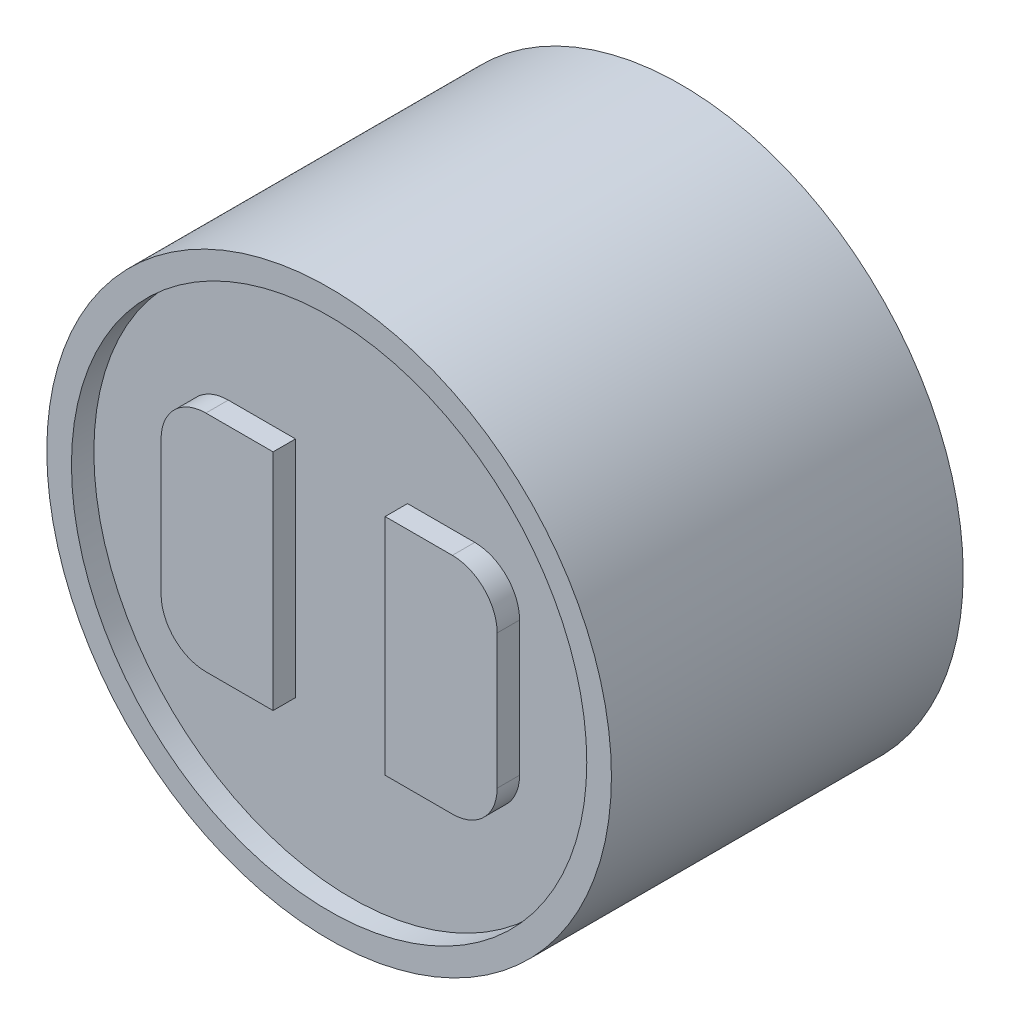
ISO-10303-21;
HEADER;
FILE_DESCRIPTION(('STEP AP214'),'2;1');
FILE_NAME('part.step','',(''),(''),'','','');
FILE_SCHEMA(('AUTOMOTIVE_DESIGN { 1 0 10303 214 1 1 1 1 }'));
ENDSEC;
DATA;
#1=APPLICATION_CONTEXT('core data for automotive mechanical design processes');
#2=APPLICATION_PROTOCOL_DEFINITION('international standard','automotive_design',2000,#1);
#3=PRODUCT_CONTEXT('',#1,'mechanical');
#4=PRODUCT('Part','Part','',(#3));
#5=PRODUCT_RELATED_PRODUCT_CATEGORY('part','',(#4));
#6=PRODUCT_DEFINITION_FORMATION('','',#4);
#7=PRODUCT_DEFINITION_CONTEXT('part definition',#1,'design');
#8=PRODUCT_DEFINITION('design','',#6,#7);
#9=PRODUCT_DEFINITION_SHAPE('','',#8);
#10=(LENGTH_UNIT() NAMED_UNIT(*) SI_UNIT(.MILLI.,.METRE.));
#11=(NAMED_UNIT(*) PLANE_ANGLE_UNIT() SI_UNIT($,.RADIAN.));
#12=(NAMED_UNIT(*) SI_UNIT($,.STERADIAN.) SOLID_ANGLE_UNIT());
#13=UNCERTAINTY_MEASURE_WITH_UNIT(LENGTH_MEASURE(1.E-05),#10,'distance_accuracy_value','');
#14=(GEOMETRIC_REPRESENTATION_CONTEXT(3) GLOBAL_UNCERTAINTY_ASSIGNED_CONTEXT((#13)) GLOBAL_UNIT_ASSIGNED_CONTEXT((#10,
#11,#12)) REPRESENTATION_CONTEXT('',''));
#15=CARTESIAN_POINT('',(0.,0.,0.));
#16=DIRECTION('',(0.,0.,1.));
#17=DIRECTION('',(1.,0.,0.));
#18=AXIS2_PLACEMENT_3D('',#15,#16,#17);
#19=CARTESIAN_POINT('',(-3.2333237010954,-8.71020362159421,28.1888965279297));
#20=DIRECTION('',(0.,0.,-1.));
#21=DIRECTION('',(-1.,0.,0.));
#22=AXIS2_PLACEMENT_3D('',#19,#20,#21);
#23=PLANE('',#22);
#24=CARTESIAN_POINT('',(-3.23332370109542,-7.18620362159421,28.1888965279297));
#25=DIRECTION('',(0.,0.,-1.));
#26=DIRECTION('',(-1.,0.,0.));
#27=AXIS2_PLACEMENT_3D('',#24,#25,#26);
#28=CIRCLE('',#27,0.508);
#29=CARTESIAN_POINT('',(-3.74132370109542,-7.18620362159421,28.1888965279297));
#30=VERTEX_POINT('',#29);
#31=CARTESIAN_POINT('',(-3.23332370109542,-6.67820362159421,28.1888965279297));
#32=VERTEX_POINT('',#31);
#33=EDGE_CURVE('E128',#30,#32,#28,.T.);
#34=ORIENTED_EDGE('',*,*,#33,.F.);
#35=DIRECTION('',(0.,1.,0.));
#36=VECTOR('',#35,1.);
#37=CARTESIAN_POINT('',(-3.74132370109541,-8.71020362159421,28.1888965279297));
#38=LINE('',#37,#36);
#39=CARTESIAN_POINT('',(-3.74132370109541,-8.71020362159421,28.1888965279297));
#40=VERTEX_POINT('',#39);
#41=EDGE_CURVE('E116',#40,#30,#38,.T.);
#42=ORIENTED_EDGE('',*,*,#41,.F.);
#43=CARTESIAN_POINT('',(-3.2333237010954,-8.71020362159421,28.1888965279297));
#44=DIRECTION('',(0.,0.,-1.));
#45=DIRECTION('',(-1.,0.,0.));
#46=AXIS2_PLACEMENT_3D('',#43,#44,#45);
#47=CIRCLE('',#46,0.508);
#48=CARTESIAN_POINT('',(-3.2333237010954,-9.21820362159421,28.1888965279297));
#49=VERTEX_POINT('',#48);
#50=EDGE_CURVE('E35',#49,#40,#47,.T.);
#51=ORIENTED_EDGE('',*,*,#50,.F.);
#52=DIRECTION('',(-1.,0.,0.));
#53=VECTOR('',#52,1.);
#54=CARTESIAN_POINT('',(-3.2333237010954,-9.21820362159421,28.1888965279297));
#55=LINE('',#54,#53);
#56=CARTESIAN_POINT('',(-2.4713237010954,-9.2182036215942,28.1888965279297));
#57=VERTEX_POINT('',#56);
#58=EDGE_CURVE('E103',#57,#49,#55,.T.);
#59=ORIENTED_EDGE('',*,*,#58,.F.);
#60=DIRECTION('',(0.,1.,0.));
#61=VECTOR('',#60,1.);
#62=CARTESIAN_POINT('',(-2.4713237010954,-9.2182036215942,28.1888965279297));
#63=LINE('',#62,#61);
#64=CARTESIAN_POINT('',(-2.47132370109542,-6.6782036215942,28.1888965279297));
#65=VERTEX_POINT('',#64);
#66=EDGE_CURVE('E189',#57,#65,#63,.T.);
#67=ORIENTED_EDGE('',*,*,#66,.T.);
#68=DIRECTION('',(-1.,0.,0.));
#69=VECTOR('',#68,1.);
#70=CARTESIAN_POINT('',(-3.23332370109542,-6.67820362159421,28.1888965279297));
#71=LINE('',#70,#69);
#72=EDGE_CURVE('E174',#65,#32,#71,.T.);
#73=ORIENTED_EDGE('',*,*,#72,.T.);
#74=EDGE_LOOP('',(#34,#42,#51,#59,#67,#73));
#75=FACE_BOUND('',#74,.T.);
#76=ADVANCED_FACE('F32',(#75),#23,.F.);
#77=CARTESIAN_POINT('',(-0.439323701095408,-8.71020362159419,28.1888965279297));
#78=DIRECTION('',(0.,0.,-1.));
#79=DIRECTION('',(-1.,0.,0.));
#80=AXIS2_PLACEMENT_3D('',#77,#78,#79);
#81=PLANE('',#80);
#82=CARTESIAN_POINT('',(-0.439323701095408,-8.71020362159419,28.1888965279297));
#83=DIRECTION('',(0.,0.,-1.));
#84=DIRECTION('',(-1.,0.,0.));
#85=AXIS2_PLACEMENT_3D('',#82,#83,#84);
#86=CIRCLE('',#85,0.508);
#87=CARTESIAN_POINT('',(0.0686762989045922,-8.71020362159418,28.1888965279297));
#88=VERTEX_POINT('',#87);
#89=CARTESIAN_POINT('',(-0.439323701095406,-9.21820362159419,28.1888965279297));
#90=VERTEX_POINT('',#89);
#91=EDGE_CURVE('E124',#88,#90,#86,.T.);
#92=ORIENTED_EDGE('',*,*,#91,.F.);
#93=DIRECTION('',(0.,1.,0.));
#94=VECTOR('',#93,1.);
#95=CARTESIAN_POINT('',(0.0686762989045922,-8.71020362159418,28.1888965279297));
#96=LINE('',#95,#94);
#97=CARTESIAN_POINT('',(0.0686762989045801,-7.18620362159418,28.1888965279297));
#98=VERTEX_POINT('',#97);
#99=EDGE_CURVE('E175',#98,#88,#96,.F.);
#100=ORIENTED_EDGE('',*,*,#99,.F.);
#101=CARTESIAN_POINT('',(-0.439323701095418,-7.18620362159419,28.1888965279297));
#102=DIRECTION('',(0.,0.,-1.));
#103=DIRECTION('',(-1.,0.,0.));
#104=AXIS2_PLACEMENT_3D('',#101,#102,#103);
#105=CIRCLE('',#104,0.508);
#106=CARTESIAN_POINT('',(-0.439323701095425,-6.67820362159419,28.1888965279297));
#107=VERTEX_POINT('',#106);
#108=EDGE_CURVE('E132',#107,#98,#105,.T.);
#109=ORIENTED_EDGE('',*,*,#108,.F.);
#110=DIRECTION('',(-1.,0.,0.));
#111=VECTOR('',#110,1.);
#112=CARTESIAN_POINT('',(-0.439323701095422,-6.67820362159419,28.1888965279297));
#113=LINE('',#112,#111);
#114=CARTESIAN_POINT('',(-1.20132370109542,-6.67820362159419,28.1888965279297));
#115=VERTEX_POINT('',#114);
#116=EDGE_CURVE('E130',#115,#107,#113,.F.);
#117=ORIENTED_EDGE('',*,*,#116,.F.);
#118=DIRECTION('',(0.,-1.,0.));
#119=VECTOR('',#118,1.);
#120=CARTESIAN_POINT('',(-1.2013237010954,-9.21820362159419,28.1888965279297));
#121=LINE('',#120,#119);
#122=CARTESIAN_POINT('',(-1.2013237010954,-9.21820362159419,28.1888965279297));
#123=VERTEX_POINT('',#122);
#124=EDGE_CURVE('E204',#115,#123,#121,.T.);
#125=ORIENTED_EDGE('',*,*,#124,.T.);
#126=DIRECTION('',(1.,0.,0.));
#127=VECTOR('',#126,1.);
#128=CARTESIAN_POINT('',(-1.2013237010954,-9.21820362159419,28.1888965279297));
#129=LINE('',#128,#127);
#130=EDGE_CURVE('E173',#123,#90,#129,.T.);
#131=ORIENTED_EDGE('',*,*,#130,.T.);
#132=EDGE_LOOP('',(#92,#100,#109,#117,#125,#131));
#133=FACE_BOUND('',#132,.T.);
#134=ADVANCED_FACE('F296',(#133),#81,.F.);
#135=CARTESIAN_POINT('',(-3.23332370109542,-7.18620362159421,28.1888965279297));
#136=DIRECTION('',(0.,0.,-1.));
#137=DIRECTION('',(-1.,0.,0.));
#138=AXIS2_PLACEMENT_3D('',#135,#136,#137);
#139=CYLINDRICAL_SURFACE('',#138,0.508);
#140=ORIENTED_EDGE('',*,*,#33,.T.);
#141=DIRECTION('',(0.,0.,-1.));
#142=VECTOR('',#141,1.);
#143=CARTESIAN_POINT('',(-3.23332370109542,-6.67820362159421,28.1888965279297));
#144=LINE('',#143,#142);
#145=CARTESIAN_POINT('',(-3.23332370109542,-6.67820362159421,27.9348965279297));
#146=VERTEX_POINT('',#145);
#147=EDGE_CURVE('E193',#32,#146,#144,.T.);
#148=ORIENTED_EDGE('',*,*,#147,.T.);
#149=CARTESIAN_POINT('',(-3.23332370109542,-7.18620362159421,27.9348965279297));
#150=DIRECTION('',(0.,0.,-1.));
#151=DIRECTION('',(-1.,0.,0.));
#152=AXIS2_PLACEMENT_3D('',#149,#150,#151);
#153=CIRCLE('',#152,0.508);
#154=CARTESIAN_POINT('',(-3.74132370109542,-7.18620362159421,27.9348965279297));
#155=VERTEX_POINT('',#154);
#156=EDGE_CURVE('E167',#155,#146,#153,.T.);
#157=ORIENTED_EDGE('',*,*,#156,.F.);
#158=DIRECTION('',(0.,0.,-1.));
#159=VECTOR('',#158,1.);
#160=CARTESIAN_POINT('',(-3.74132370109542,-7.18620362159421,28.1888965279297));
#161=LINE('',#160,#159);
#162=EDGE_CURVE('E125',#155,#30,#161,.F.);
#163=ORIENTED_EDGE('',*,*,#162,.T.);
#164=EDGE_LOOP('',(#140,#148,#157,#163));
#165=FACE_BOUND('',#164,.T.);
#166=ADVANCED_FACE('F450',(#165),#139,.T.);
#167=CARTESIAN_POINT('',(-3.23332370109542,-6.67820362159421,28.1888965279297));
#168=DIRECTION('',(0.,-1.,0.));
#169=DIRECTION('',(-1.,0.,0.));
#170=AXIS2_PLACEMENT_3D('',#167,#168,#169);
#171=PLANE('',#170);
#172=ORIENTED_EDGE('',*,*,#147,.F.);
#173=ORIENTED_EDGE('',*,*,#72,.F.);
#174=DIRECTION('',(0.,0.,-1.));
#175=VECTOR('',#174,1.);
#176=CARTESIAN_POINT('',(-2.47132370109542,-6.6782036215942,28.1888965279297));
#177=LINE('',#176,#175);
#178=CARTESIAN_POINT('',(-2.47132370109542,-6.6782036215942,27.9348965279297));
#179=VERTEX_POINT('',#178);
#180=EDGE_CURVE('E192',#65,#179,#177,.T.);
#181=ORIENTED_EDGE('',*,*,#180,.T.);
#182=DIRECTION('',(1.,0.,0.));
#183=VECTOR('',#182,1.);
#184=CARTESIAN_POINT('',(-1.83632370109542,-6.6782036215942,27.9348965279297));
#185=LINE('',#184,#183);
#186=EDGE_CURVE('E170',#146,#179,#185,.T.);
#187=ORIENTED_EDGE('',*,*,#186,.F.);
#188=EDGE_LOOP('',(#172,#173,#181,#187));
#189=FACE_BOUND('',#188,.T.);
#190=ADVANCED_FACE('F235',(#189),#171,.F.);
#191=CARTESIAN_POINT('',(-2.4713237010954,-9.2182036215942,28.1888965279297));
#192=DIRECTION('',(-1.,0.,0.));
#193=DIRECTION('',(0.,1.,0.));
#194=AXIS2_PLACEMENT_3D('',#191,#192,#193);
#195=PLANE('',#194);
#196=ORIENTED_EDGE('',*,*,#180,.F.);
#197=ORIENTED_EDGE('',*,*,#66,.F.);
#198=DIRECTION('',(0.,0.,-1.));
#199=VECTOR('',#198,1.);
#200=CARTESIAN_POINT('',(-2.4713237010954,-9.2182036215942,28.1888965279297));
#201=LINE('',#200,#199);
#202=CARTESIAN_POINT('',(-2.4713237010954,-9.2182036215942,27.9348965279297));
#203=VERTEX_POINT('',#202);
#204=EDGE_CURVE('E222',#57,#203,#201,.T.);
#205=ORIENTED_EDGE('',*,*,#204,.T.);
#206=DIRECTION('',(0.,1.,0.));
#207=VECTOR('',#206,1.);
#208=CARTESIAN_POINT('',(-2.47132370109541,-7.9482036215942,27.9348965279297));
#209=LINE('',#208,#207);
#210=EDGE_CURVE('E227',#179,#203,#209,.F.);
#211=ORIENTED_EDGE('',*,*,#210,.F.);
#212=EDGE_LOOP('',(#196,#197,#205,#211));
#213=FACE_BOUND('',#212,.T.);
#214=ADVANCED_FACE('F240',(#213),#195,.F.);
#215=CARTESIAN_POINT('',(-3.2333237010954,-9.21820362159421,28.1888965279297));
#216=DIRECTION('',(0.,1.,0.));
#217=DIRECTION('',(1.,0.,0.));
#218=AXIS2_PLACEMENT_3D('',#215,#216,#217);
#219=PLANE('',#218);
#220=ORIENTED_EDGE('',*,*,#204,.F.);
#221=ORIENTED_EDGE('',*,*,#58,.T.);
#222=DIRECTION('',(0.,0.,-1.));
#223=VECTOR('',#222,1.);
#224=CARTESIAN_POINT('',(-3.2333237010954,-9.21820362159421,28.1888965279297));
#225=LINE('',#224,#223);
#226=CARTESIAN_POINT('',(-3.2333237010954,-9.21820362159421,27.9348965279297));
#227=VERTEX_POINT('',#226);
#228=EDGE_CURVE('E113',#227,#49,#225,.F.);
#229=ORIENTED_EDGE('',*,*,#228,.F.);
#230=DIRECTION('',(1.,0.,0.));
#231=VECTOR('',#230,1.);
#232=CARTESIAN_POINT('',(-1.8363237010954,-9.2182036215942,27.9348965279297));
#233=LINE('',#232,#231);
#234=EDGE_CURVE('E166',#203,#227,#233,.F.);
#235=ORIENTED_EDGE('',*,*,#234,.F.);
#236=EDGE_LOOP('',(#220,#221,#229,#235));
#237=FACE_BOUND('',#236,.T.);
#238=ADVANCED_FACE('F290',(#237),#219,.F.);
#239=CARTESIAN_POINT('',(-3.2333237010954,-8.71020362159421,28.1888965279297));
#240=DIRECTION('',(0.,0.,-1.));
#241=DIRECTION('',(-1.,0.,0.));
#242=AXIS2_PLACEMENT_3D('',#239,#240,#241);
#243=CYLINDRICAL_SURFACE('',#242,0.508);
#244=ORIENTED_EDGE('',*,*,#50,.T.);
#245=DIRECTION('',(0.,0.,-1.));
#246=VECTOR('',#245,1.);
#247=CARTESIAN_POINT('',(-3.74132370109541,-8.71020362159421,28.1888965279297));
#248=LINE('',#247,#246);
#249=CARTESIAN_POINT('',(-3.74132370109541,-8.71020362159421,27.9348965279297));
#250=VERTEX_POINT('',#249);
#251=EDGE_CURVE('E111',#40,#250,#248,.T.);
#252=ORIENTED_EDGE('',*,*,#251,.T.);
#253=CARTESIAN_POINT('',(-3.2333237010954,-8.71020362159421,27.9348965279297));
#254=DIRECTION('',(0.,0.,-1.));
#255=DIRECTION('',(-1.,0.,0.));
#256=AXIS2_PLACEMENT_3D('',#253,#254,#255);
#257=CIRCLE('',#256,0.508);
#258=EDGE_CURVE('E164',#227,#250,#257,.T.);
#259=ORIENTED_EDGE('',*,*,#258,.F.);
#260=ORIENTED_EDGE('',*,*,#228,.T.);
#261=EDGE_LOOP('',(#244,#252,#259,#260));
#262=FACE_BOUND('',#261,.T.);
#263=ADVANCED_FACE('F109',(#262),#243,.T.);
#264=CARTESIAN_POINT('',(-3.74132370109541,-8.71020362159421,28.1888965279297));
#265=DIRECTION('',(1.,0.,0.));
#266=DIRECTION('',(0.,-1.,0.));
#267=AXIS2_PLACEMENT_3D('',#264,#265,#266);
#268=PLANE('',#267);
#269=ORIENTED_EDGE('',*,*,#251,.F.);
#270=ORIENTED_EDGE('',*,*,#41,.T.);
#271=ORIENTED_EDGE('',*,*,#162,.F.);
#272=DIRECTION('',(0.,1.,0.));
#273=VECTOR('',#272,1.);
#274=CARTESIAN_POINT('',(-3.74132370109542,-7.94820362159421,27.9348965279297));
#275=LINE('',#274,#273);
#276=EDGE_CURVE('E122',#250,#155,#275,.T.);
#277=ORIENTED_EDGE('',*,*,#276,.F.);
#278=EDGE_LOOP('',(#269,#270,#271,#277));
#279=FACE_BOUND('',#278,.T.);
#280=ADVANCED_FACE('F118',(#279),#268,.F.);
#281=CARTESIAN_POINT('',(-0.439323701095408,-8.71020362159419,28.1888965279297));
#282=DIRECTION('',(0.,0.,-1.));
#283=DIRECTION('',(-1.,0.,0.));
#284=AXIS2_PLACEMENT_3D('',#281,#282,#283);
#285=CYLINDRICAL_SURFACE('',#284,0.508);
#286=ORIENTED_EDGE('',*,*,#91,.T.);
#287=DIRECTION('',(0.,0.,-1.));
#288=VECTOR('',#287,1.);
#289=CARTESIAN_POINT('',(-0.439323701095408,-9.21820362159419,28.1888965279297));
#290=LINE('',#289,#288);
#291=CARTESIAN_POINT('',(-0.439323701095406,-9.21820362159419,27.9348965279297));
#292=VERTEX_POINT('',#291);
#293=EDGE_CURVE('E208',#90,#292,#290,.T.);
#294=ORIENTED_EDGE('',*,*,#293,.T.);
#295=CARTESIAN_POINT('',(-0.439323701095408,-8.71020362159419,27.9348965279297));
#296=DIRECTION('',(0.,0.,-1.));
#297=DIRECTION('',(-1.,0.,0.));
#298=AXIS2_PLACEMENT_3D('',#295,#296,#297);
#299=CIRCLE('',#298,0.508);
#300=CARTESIAN_POINT('',(0.0686762989045922,-8.71020362159418,27.9348965279297));
#301=VERTEX_POINT('',#300);
#302=EDGE_CURVE('E160',#301,#292,#299,.T.);
#303=ORIENTED_EDGE('',*,*,#302,.F.);
#304=DIRECTION('',(0.,0.,-1.));
#305=VECTOR('',#304,1.);
#306=CARTESIAN_POINT('',(0.0686762989045922,-8.71020362159418,28.1888965279297));
#307=LINE('',#306,#305);
#308=EDGE_CURVE('E253',#301,#88,#307,.F.);
#309=ORIENTED_EDGE('',*,*,#308,.T.);
#310=EDGE_LOOP('',(#286,#294,#303,#309));
#311=FACE_BOUND('',#310,.T.);
#312=ADVANCED_FACE('F302',(#311),#285,.T.);
#313=CARTESIAN_POINT('',(-1.2013237010954,-9.21820362159419,28.1888965279297));
#314=DIRECTION('',(0.,1.,0.));
#315=DIRECTION('',(1.,0.,0.));
#316=AXIS2_PLACEMENT_3D('',#313,#314,#315);
#317=PLANE('',#316);
#318=ORIENTED_EDGE('',*,*,#293,.F.);
#319=ORIENTED_EDGE('',*,*,#130,.F.);
#320=DIRECTION('',(0.,0.,-1.));
#321=VECTOR('',#320,1.);
#322=CARTESIAN_POINT('',(-1.2013237010954,-9.21820362159419,28.1888965279297));
#323=LINE('',#322,#321);
#324=CARTESIAN_POINT('',(-1.2013237010954,-9.21820362159419,27.9348965279297));
#325=VERTEX_POINT('',#324);
#326=EDGE_CURVE('E207',#123,#325,#323,.T.);
#327=ORIENTED_EDGE('',*,*,#326,.T.);
#328=DIRECTION('',(1.,0.,0.));
#329=VECTOR('',#328,1.);
#330=CARTESIAN_POINT('',(-1.8363237010954,-9.2182036215942,27.9348965279297));
#331=LINE('',#330,#329);
#332=EDGE_CURVE('E163',#292,#325,#331,.F.);
#333=ORIENTED_EDGE('',*,*,#332,.F.);
#334=EDGE_LOOP('',(#318,#319,#327,#333));
#335=FACE_BOUND('',#334,.T.);
#336=ADVANCED_FACE('F271',(#335),#317,.F.);
#337=CARTESIAN_POINT('',(-1.2013237010954,-9.21820362159419,28.1888965279297));
#338=DIRECTION('',(1.,0.,0.));
#339=DIRECTION('',(0.,-1.,0.));
#340=AXIS2_PLACEMENT_3D('',#337,#338,#339);
#341=PLANE('',#340);
#342=ORIENTED_EDGE('',*,*,#326,.F.);
#343=ORIENTED_EDGE('',*,*,#124,.F.);
#344=DIRECTION('',(0.,0.,-1.));
#345=VECTOR('',#344,1.);
#346=CARTESIAN_POINT('',(-1.20132370109542,-6.67820362159419,28.1888965279297));
#347=LINE('',#346,#345);
#348=CARTESIAN_POINT('',(-1.20132370109542,-6.67820362159419,27.9348965279297));
#349=VERTEX_POINT('',#348);
#350=EDGE_CURVE('E258',#115,#349,#347,.T.);
#351=ORIENTED_EDGE('',*,*,#350,.T.);
#352=DIRECTION('',(0.,1.,0.));
#353=VECTOR('',#352,1.);
#354=CARTESIAN_POINT('',(-1.20132370109541,-7.94820362159419,27.9348965279297));
#355=LINE('',#354,#353);
#356=EDGE_CURVE('E263',#325,#349,#355,.T.);
#357=ORIENTED_EDGE('',*,*,#356,.F.);
#358=EDGE_LOOP('',(#342,#343,#351,#357));
#359=FACE_BOUND('',#358,.T.);
#360=ADVANCED_FACE('F276',(#359),#341,.F.);
#361=CARTESIAN_POINT('',(-1.20132370109542,-6.67820362159419,28.1888965279297));
#362=DIRECTION('',(0.,-1.,0.));
#363=DIRECTION('',(-1.,0.,0.));
#364=AXIS2_PLACEMENT_3D('',#361,#362,#363);
#365=PLANE('',#364);
#366=ORIENTED_EDGE('',*,*,#350,.F.);
#367=ORIENTED_EDGE('',*,*,#116,.T.);
#368=DIRECTION('',(0.,0.,-1.));
#369=VECTOR('',#368,1.);
#370=CARTESIAN_POINT('',(-0.439323701095427,-6.67820362159419,28.1888965279297));
#371=LINE('',#370,#369);
#372=CARTESIAN_POINT('',(-0.439323701095425,-6.67820362159419,27.9348965279297));
#373=VERTEX_POINT('',#372);
#374=EDGE_CURVE('E256',#373,#107,#371,.F.);
#375=ORIENTED_EDGE('',*,*,#374,.F.);
#376=DIRECTION('',(1.,0.,0.));
#377=VECTOR('',#376,1.);
#378=CARTESIAN_POINT('',(-1.83632370109542,-6.6782036215942,27.9348965279297));
#379=LINE('',#378,#377);
#380=EDGE_CURVE('E159',#349,#373,#379,.T.);
#381=ORIENTED_EDGE('',*,*,#380,.F.);
#382=EDGE_LOOP('',(#366,#367,#375,#381));
#383=FACE_BOUND('',#382,.T.);
#384=ADVANCED_FACE('F298',(#383),#365,.F.);
#385=CARTESIAN_POINT('',(-0.439323701095418,-7.18620362159419,28.1888965279297));
#386=DIRECTION('',(0.,0.,-1.));
#387=DIRECTION('',(-1.,0.,0.));
#388=AXIS2_PLACEMENT_3D('',#385,#386,#387);
#389=CYLINDRICAL_SURFACE('',#388,0.508);
#390=ORIENTED_EDGE('',*,*,#108,.T.);
#391=DIRECTION('',(0.,0.,-1.));
#392=VECTOR('',#391,1.);
#393=CARTESIAN_POINT('',(0.0686762989045801,-7.18620362159418,28.1888965279297));
#394=LINE('',#393,#392);
#395=CARTESIAN_POINT('',(0.0686762989045801,-7.18620362159418,27.9348965279297));
#396=VERTEX_POINT('',#395);
#397=EDGE_CURVE('E50',#98,#396,#394,.T.);
#398=ORIENTED_EDGE('',*,*,#397,.T.);
#399=CARTESIAN_POINT('',(-0.439323701095418,-7.18620362159419,27.9348965279297));
#400=DIRECTION('',(0.,0.,-1.));
#401=DIRECTION('',(-1.,0.,0.));
#402=AXIS2_PLACEMENT_3D('',#399,#400,#401);
#403=CIRCLE('',#402,0.508);
#404=EDGE_CURVE('E156',#373,#396,#403,.T.);
#405=ORIENTED_EDGE('',*,*,#404,.F.);
#406=ORIENTED_EDGE('',*,*,#374,.T.);
#407=EDGE_LOOP('',(#390,#398,#405,#406));
#408=FACE_BOUND('',#407,.T.);
#409=ADVANCED_FACE('F343',(#408),#389,.T.);
#410=CARTESIAN_POINT('',(0.0686762989045922,-8.71020362159418,28.1888965279297));
#411=DIRECTION('',(-1.,0.,0.));
#412=DIRECTION('',(0.,1.,0.));
#413=AXIS2_PLACEMENT_3D('',#410,#411,#412);
#414=PLANE('',#413);
#415=ORIENTED_EDGE('',*,*,#397,.F.);
#416=ORIENTED_EDGE('',*,*,#99,.T.);
#417=ORIENTED_EDGE('',*,*,#308,.F.);
#418=DIRECTION('',(0.,1.,0.));
#419=VECTOR('',#418,1.);
#420=CARTESIAN_POINT('',(0.068676298904587,-7.94820362159418,27.9348965279297));
#421=LINE('',#420,#419);
#422=EDGE_CURVE('E155',#396,#301,#421,.F.);
#423=ORIENTED_EDGE('',*,*,#422,.F.);
#424=EDGE_LOOP('',(#415,#416,#417,#423));
#425=FACE_BOUND('',#424,.T.);
#426=ADVANCED_FACE('F301',(#425),#414,.F.);
#427=CARTESIAN_POINT('',(-1.83632370109541,-7.9482036215942,24.8360965279297));
#428=DIRECTION('',(0.,0.,-1.));
#429=DIRECTION('',(-1.,0.,0.));
#430=AXIS2_PLACEMENT_3D('',#427,#428,#429);
#431=PLANE('',#430);
#432=CARTESIAN_POINT('',(-1.83632370109541,-7.9482036215942,24.8360965279297));
#433=DIRECTION('',(0.,0.,-1.));
#434=DIRECTION('',(-1.,0.,0.));
#435=AXIS2_PLACEMENT_3D('',#432,#433,#434);
#436=CIRCLE('',#435,0.635);
#437=CARTESIAN_POINT('',(-2.47132370109541,-7.94820362159421,24.8360965279297));
#438=VERTEX_POINT('',#437);
#439=EDGE_CURVE('E152',#438,#438,#436,.T.);
#440=ORIENTED_EDGE('',*,*,#439,.T.);
#441=EDGE_LOOP('',(#440));
#442=FACE_BOUND('',#441,.T.);
#443=ADVANCED_FACE('F337',(#442),#431,.T.);
#444=CARTESIAN_POINT('',(-1.83632370109541,-7.9482036215942,27.9348965279297));
#445=DIRECTION('',(0.,0.,1.));
#446=DIRECTION('',(1.,0.,0.));
#447=AXIS2_PLACEMENT_3D('',#444,#445,#446);
#448=PLANE('',#447);
#449=ORIENTED_EDGE('',*,*,#404,.T.);
#450=ORIENTED_EDGE('',*,*,#422,.T.);
#451=ORIENTED_EDGE('',*,*,#302,.T.);
#452=ORIENTED_EDGE('',*,*,#332,.T.);
#453=ORIENTED_EDGE('',*,*,#356,.T.);
#454=ORIENTED_EDGE('',*,*,#380,.T.);
#455=EDGE_LOOP('',(#449,#450,#451,#452,#453,#454));
#456=FACE_BOUND('',#455,.T.);
#457=CARTESIAN_POINT('',(-1.83632370109541,-7.9482036215942,27.9348965279297));
#458=DIRECTION('',(0.,0.,1.));
#459=DIRECTION('',(1.,0.,0.));
#460=AXIS2_PLACEMENT_3D('',#457,#458,#459);
#461=CIRCLE('',#460,2.921);
#462=CARTESIAN_POINT('',(1.08467629890459,-7.94820362159418,27.9348965279297));
#463=VERTEX_POINT('',#462);
#464=EDGE_CURVE('E149',#463,#463,#461,.T.);
#465=ORIENTED_EDGE('',*,*,#464,.T.);
#466=EDGE_LOOP('',(#465));
#467=FACE_BOUND('',#466,.T.);
#468=ORIENTED_EDGE('',*,*,#258,.T.);
#469=ORIENTED_EDGE('',*,*,#276,.T.);
#470=ORIENTED_EDGE('',*,*,#156,.T.);
#471=ORIENTED_EDGE('',*,*,#186,.T.);
#472=ORIENTED_EDGE('',*,*,#210,.T.);
#473=ORIENTED_EDGE('',*,*,#234,.T.);
#474=EDGE_LOOP('',(#468,#469,#470,#471,#472,#473));
#475=FACE_BOUND('',#474,.T.);
#476=ADVANCED_FACE('F244',(#456,#467,#475),#448,.T.);
#477=CARTESIAN_POINT('',(-1.83632370109541,-7.9482036215942,24.8360965279297));
#478=DIRECTION('',(0.,0.,-1.));
#479=DIRECTION('',(-1.,0.,0.));
#480=AXIS2_PLACEMENT_3D('',#477,#478,#479);
#481=CYLINDRICAL_SURFACE('',#480,0.635);
#482=CARTESIAN_POINT('',(-1.83632370109541,-7.9482036215942,24.2010965279297));
#483=DIRECTION('',(0.,0.,-1.));
#484=DIRECTION('',(-1.,0.,0.));
#485=AXIS2_PLACEMENT_3D('',#482,#483,#484);
#486=CIRCLE('',#485,0.635);
#487=CARTESIAN_POINT('',(-2.47132370109541,-7.94820362159421,24.2010965279297));
#488=VERTEX_POINT('',#487);
#489=EDGE_CURVE('E146',#488,#488,#486,.F.);
#490=ORIENTED_EDGE('',*,*,#489,.F.);
#491=EDGE_LOOP('',(#490));
#492=FACE_BOUND('',#491,.T.);
#493=ORIENTED_EDGE('',*,*,#439,.F.);
#494=EDGE_LOOP('',(#493));
#495=FACE_BOUND('',#494,.T.);
#496=ADVANCED_FACE('F330',(#492,#495),#481,.F.);
#497=CARTESIAN_POINT('',(-1.83632370109541,-7.9482036215942,27.9348965279297));
#498=DIRECTION('',(0.,0.,1.));
#499=DIRECTION('',(1.,0.,0.));
#500=AXIS2_PLACEMENT_3D('',#497,#498,#499);
#501=CYLINDRICAL_SURFACE('',#500,2.921);
#502=ORIENTED_EDGE('',*,*,#464,.F.);
#503=EDGE_LOOP('',(#502));
#504=FACE_BOUND('',#503,.T.);
#505=CARTESIAN_POINT('',(-1.83632370109541,-7.9482036215942,28.1888965279297));
#506=DIRECTION('',(0.,0.,1.));
#507=DIRECTION('',(1.,0.,0.));
#508=AXIS2_PLACEMENT_3D('',#505,#506,#507);
#509=CIRCLE('',#508,2.921);
#510=CARTESIAN_POINT('',(1.08467629890459,-7.94820362159418,28.1888965279297));
#511=VERTEX_POINT('',#510);
#512=EDGE_CURVE('E143',#511,#511,#509,.T.);
#513=ORIENTED_EDGE('',*,*,#512,.T.);
#514=EDGE_LOOP('',(#513));
#515=FACE_BOUND('',#514,.T.);
#516=ADVANCED_FACE('F326',(#504,#515),#501,.F.);
#517=CARTESIAN_POINT('',(-1.83632370109541,-7.9482036215942,24.2010965279297));
#518=DIRECTION('',(0.,0.,-1.));
#519=DIRECTION('',(-1.,0.,0.));
#520=AXIS2_PLACEMENT_3D('',#517,#518,#519);
#521=PLANE('',#520);
#522=CARTESIAN_POINT('',(-1.83632370109541,-7.9482036215942,24.2010965279297));
#523=DIRECTION('',(0.,0.,1.));
#524=DIRECTION('',(1.,0.,0.));
#525=AXIS2_PLACEMENT_3D('',#522,#523,#524);
#526=CIRCLE('',#525,3.2004);
#527=CARTESIAN_POINT('',(1.36407629890458,-7.94820362159418,24.2010965279297));
#528=VERTEX_POINT('',#527);
#529=EDGE_CURVE('E41',#528,#528,#526,.T.);
#530=ORIENTED_EDGE('',*,*,#529,.F.);
#531=EDGE_LOOP('',(#530));
#532=FACE_BOUND('',#531,.T.);
#533=ORIENTED_EDGE('',*,*,#489,.T.);
#534=EDGE_LOOP('',(#533));
#535=FACE_BOUND('',#534,.T.);
#536=ADVANCED_FACE('F319',(#532,#535),#521,.T.);
#537=CARTESIAN_POINT('',(-1.83632370109541,-7.9482036215942,28.1888965279297));
#538=DIRECTION('',(0.,0.,-1.));
#539=DIRECTION('',(-1.,0.,0.));
#540=AXIS2_PLACEMENT_3D('',#537,#538,#539);
#541=PLANE('',#540);
#542=CARTESIAN_POINT('',(-1.83632370109541,-7.9482036215942,28.1888965279297));
#543=DIRECTION('',(0.,0.,1.));
#544=DIRECTION('',(1.,0.,0.));
#545=AXIS2_PLACEMENT_3D('',#542,#543,#544);
#546=CIRCLE('',#545,3.2004);
#547=CARTESIAN_POINT('',(1.36407629890458,-7.94820362159418,28.1888965279297));
#548=VERTEX_POINT('',#547);
#549=EDGE_CURVE('E11',#548,#548,#546,.F.);
#550=ORIENTED_EDGE('',*,*,#549,.F.);
#551=EDGE_LOOP('',(#550));
#552=FACE_BOUND('',#551,.T.);
#553=ORIENTED_EDGE('',*,*,#512,.F.);
#554=EDGE_LOOP('',(#553));
#555=FACE_BOUND('',#554,.T.);
#556=ADVANCED_FACE('F313',(#552,#555),#541,.F.);
#557=CARTESIAN_POINT('',(-1.83632370109541,-7.9482036215942,24.2010965279297));
#558=DIRECTION('',(0.,0.,1.));
#559=DIRECTION('',(1.,0.,0.));
#560=AXIS2_PLACEMENT_3D('',#557,#558,#559);
#561=CYLINDRICAL_SURFACE('',#560,3.2004);
#562=ORIENTED_EDGE('',*,*,#549,.T.);
#563=EDGE_LOOP('',(#562));
#564=FACE_BOUND('',#563,.T.);
#565=ORIENTED_EDGE('',*,*,#529,.T.);
#566=EDGE_LOOP('',(#565));
#567=FACE_BOUND('',#566,.T.);
#568=ADVANCED_FACE('F311',(#564,#567),#561,.T.);
#569=CLOSED_SHELL('',(#76,#134,#166,#190,#214,#238,#263,#280,#312,#336,#360,#384,#409,#426,#443,
#476,#496,#516,#536,#556,#568));
#570=MANIFOLD_SOLID_BREP('B2',#569);
#571=ADVANCED_BREP_SHAPE_REPRESENTATION('',(#18,#570),#14);
#572=SHAPE_DEFINITION_REPRESENTATION(#9,#571);
ENDSEC;
END-ISO-10303-21;
